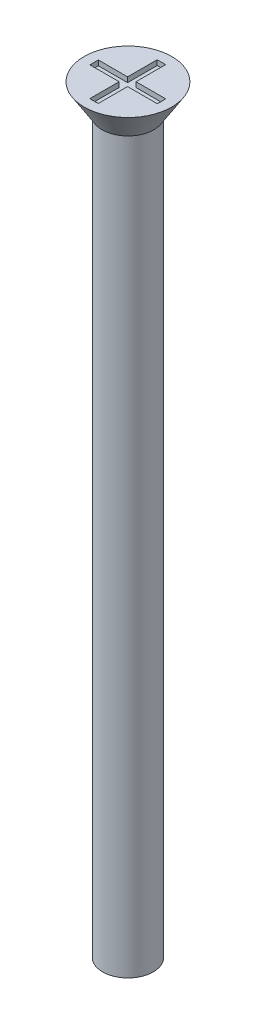
ISO-10303-21;
HEADER;
FILE_DESCRIPTION(('STEP AP214'),'2;1');
FILE_NAME('part.step','',(''),(''),'','','');
FILE_SCHEMA(('AUTOMOTIVE_DESIGN { 1 0 10303 214 1 1 1 1 }'));
ENDSEC;
DATA;
#1=APPLICATION_CONTEXT('core data for automotive mechanical design processes');
#2=APPLICATION_PROTOCOL_DEFINITION('international standard','automotive_design',2000,#1);
#3=PRODUCT_CONTEXT('',#1,'mechanical');
#4=PRODUCT('Part','Part','',(#3));
#5=PRODUCT_RELATED_PRODUCT_CATEGORY('part','',(#4));
#6=PRODUCT_DEFINITION_FORMATION('','',#4);
#7=PRODUCT_DEFINITION_CONTEXT('part definition',#1,'design');
#8=PRODUCT_DEFINITION('design','',#6,#7);
#9=PRODUCT_DEFINITION_SHAPE('','',#8);
#10=(LENGTH_UNIT() NAMED_UNIT(*) SI_UNIT(.MILLI.,.METRE.));
#11=(NAMED_UNIT(*) PLANE_ANGLE_UNIT() SI_UNIT($,.RADIAN.));
#12=(NAMED_UNIT(*) SI_UNIT($,.STERADIAN.) SOLID_ANGLE_UNIT());
#13=UNCERTAINTY_MEASURE_WITH_UNIT(LENGTH_MEASURE(1.E-05),#10,'distance_accuracy_value','');
#14=(GEOMETRIC_REPRESENTATION_CONTEXT(3) GLOBAL_UNCERTAINTY_ASSIGNED_CONTEXT((#13)) GLOBAL_UNIT_ASSIGNED_CONTEXT((#10,
#11,#12)) REPRESENTATION_CONTEXT('',''));
#15=CARTESIAN_POINT('',(0.,0.,0.));
#16=DIRECTION('',(0.,0.,1.));
#17=DIRECTION('',(1.,0.,0.));
#18=AXIS2_PLACEMENT_3D('',#15,#16,#17);
#19=CARTESIAN_POINT('',(0.,45.,0.));
#20=DIRECTION('',(0.,1.,0.));
#21=DIRECTION('',(0.,0.,1.));
#22=AXIS2_PLACEMENT_3D('',#19,#20,#21);
#23=PLANE('',#22);
#24=CARTESIAN_POINT('',(0.,45.,0.));
#25=DIRECTION('',(0.,1.,0.));
#26=DIRECTION('',(0.,0.,1.));
#27=AXIS2_PLACEMENT_3D('',#24,#25,#26);
#28=CIRCLE('',#27,2.6);
#29=CARTESIAN_POINT('',(0.,45.,2.6));
#30=VERTEX_POINT('',#29);
#31=EDGE_CURVE('E192',#30,#30,#28,.T.);
#32=ORIENTED_EDGE('',*,*,#31,.T.);
#33=EDGE_LOOP('',(#32));
#34=FACE_BOUND('',#33,.T.);
#35=DIRECTION('',(1.,0.,0.));
#36=VECTOR('',#35,1.);
#37=CARTESIAN_POINT('',(0.,45.,-2.));
#38=LINE('',#37,#36);
#39=CARTESIAN_POINT('',(-0.265272843023468,45.,-2.));
#40=VERTEX_POINT('',#39);
#41=CARTESIAN_POINT('',(0.234727156976532,45.,-2.));
#42=VERTEX_POINT('',#41);
#43=EDGE_CURVE('E161',#40,#42,#38,.T.);
#44=ORIENTED_EDGE('',*,*,#43,.T.);
#45=DIRECTION('',(0.,0.,1.));
#46=VECTOR('',#45,1.);
#47=CARTESIAN_POINT('',(0.234727156976532,45.,0.));
#48=LINE('',#47,#46);
#49=CARTESIAN_POINT('',(0.234727156976532,45.,-0.241621514992573));
#50=VERTEX_POINT('',#49);
#51=EDGE_CURVE('E48',#42,#50,#48,.T.);
#52=ORIENTED_EDGE('',*,*,#51,.T.);
#53=DIRECTION('',(1.,0.,0.));
#54=VECTOR('',#53,1.);
#55=CARTESIAN_POINT('',(0.,45.,-0.241621514992573));
#56=LINE('',#55,#54);
#57=CARTESIAN_POINT('',(2.,45.,-0.241621514992573));
#58=VERTEX_POINT('',#57);
#59=EDGE_CURVE('E98',#50,#58,#56,.T.);
#60=ORIENTED_EDGE('',*,*,#59,.T.);
#61=DIRECTION('',(0.,0.,1.));
#62=VECTOR('',#61,1.);
#63=CARTESIAN_POINT('',(2.,45.,0.));
#64=LINE('',#63,#62);
#65=CARTESIAN_POINT('',(2.,45.,0.258378485007427));
#66=VERTEX_POINT('',#65);
#67=EDGE_CURVE('E186',#58,#66,#64,.T.);
#68=ORIENTED_EDGE('',*,*,#67,.T.);
#69=DIRECTION('',(1.,0.,0.));
#70=VECTOR('',#69,1.);
#71=CARTESIAN_POINT('',(0.,45.,0.258378485007427));
#72=LINE('',#71,#70);
#73=CARTESIAN_POINT('',(0.234727156976532,45.,0.258378485007427));
#74=VERTEX_POINT('',#73);
#75=EDGE_CURVE('E145',#74,#66,#72,.T.);
#76=ORIENTED_EDGE('',*,*,#75,.F.);
#77=DIRECTION('',(0.,0.,1.));
#78=VECTOR('',#77,1.);
#79=CARTESIAN_POINT('',(0.234727156976532,45.,0.));
#80=LINE('',#79,#78);
#81=CARTESIAN_POINT('',(0.234727156976533,45.,2.));
#82=VERTEX_POINT('',#81);
#83=EDGE_CURVE('E182',#74,#82,#80,.T.);
#84=ORIENTED_EDGE('',*,*,#83,.T.);
#85=DIRECTION('',(1.,0.,0.));
#86=VECTOR('',#85,1.);
#87=CARTESIAN_POINT('',(0.,45.,2.));
#88=LINE('',#87,#86);
#89=CARTESIAN_POINT('',(-0.265272843023467,45.,2.));
#90=VERTEX_POINT('',#89);
#91=EDGE_CURVE('E179',#90,#82,#88,.T.);
#92=ORIENTED_EDGE('',*,*,#91,.F.);
#93=DIRECTION('',(0.,0.,1.));
#94=VECTOR('',#93,1.);
#95=CARTESIAN_POINT('',(-0.265272843023468,45.,0.));
#96=LINE('',#95,#94);
#97=CARTESIAN_POINT('',(-0.265272843023468,45.,0.258378485007427));
#98=VERTEX_POINT('',#97);
#99=EDGE_CURVE('E176',#98,#90,#96,.T.);
#100=ORIENTED_EDGE('',*,*,#99,.F.);
#101=DIRECTION('',(1.,0.,0.));
#102=VECTOR('',#101,1.);
#103=CARTESIAN_POINT('',(0.,45.,0.258378485007427));
#104=LINE('',#103,#102);
#105=CARTESIAN_POINT('',(-2.,45.,0.258378485007427));
#106=VERTEX_POINT('',#105);
#107=EDGE_CURVE('E173',#106,#98,#104,.T.);
#108=ORIENTED_EDGE('',*,*,#107,.F.);
#109=DIRECTION('',(0.,0.,1.));
#110=VECTOR('',#109,1.);
#111=CARTESIAN_POINT('',(-2.,45.,0.));
#112=LINE('',#111,#110);
#113=CARTESIAN_POINT('',(-2.,45.,-0.241621514992573));
#114=VERTEX_POINT('',#113);
#115=EDGE_CURVE('E170',#114,#106,#112,.T.);
#116=ORIENTED_EDGE('',*,*,#115,.F.);
#117=DIRECTION('',(1.,0.,0.));
#118=VECTOR('',#117,1.);
#119=CARTESIAN_POINT('',(0.,45.,-0.241621514992573));
#120=LINE('',#119,#118);
#121=CARTESIAN_POINT('',(-0.265272843023468,45.,-0.241621514992573));
#122=VERTEX_POINT('',#121);
#123=EDGE_CURVE('E167',#114,#122,#120,.T.);
#124=ORIENTED_EDGE('',*,*,#123,.T.);
#125=DIRECTION('',(0.,0.,1.));
#126=VECTOR('',#125,1.);
#127=CARTESIAN_POINT('',(-0.265272843023468,45.,0.));
#128=LINE('',#127,#126);
#129=EDGE_CURVE('E164',#40,#122,#128,.T.);
#130=ORIENTED_EDGE('',*,*,#129,.F.);
#131=EDGE_LOOP('',(#44,#52,#60,#68,#76,#84,#92,#100,#108,#116,#124,#130));
#132=FACE_BOUND('',#131,.T.);
#133=ADVANCED_FACE('F33',(#34,#132),#23,.T.);
#134=CARTESIAN_POINT('',(0.,45.,0.));
#135=DIRECTION('',(0.,-1.,0.));
#136=DIRECTION('',(0.,0.,-1.));
#137=AXIS2_PLACEMENT_3D('',#134,#135,#136);
#138=CYLINDRICAL_SURFACE('',#137,1.5);
#139=CARTESIAN_POINT('',(0.,0.,0.));
#140=DIRECTION('',(0.,1.,0.));
#141=DIRECTION('',(0.,0.,1.));
#142=AXIS2_PLACEMENT_3D('',#139,#140,#141);
#143=CIRCLE('',#142,1.5);
#144=CARTESIAN_POINT('',(0.,0.,1.5));
#145=VERTEX_POINT('',#144);
#146=EDGE_CURVE('E41',#145,#145,#143,.T.);
#147=ORIENTED_EDGE('',*,*,#146,.T.);
#148=EDGE_LOOP('',(#147));
#149=FACE_BOUND('',#148,.T.);
#150=CARTESIAN_POINT('',(0.,43.3,0.));
#151=DIRECTION('',(0.,1.,0.));
#152=DIRECTION('',(0.,0.,1.));
#153=AXIS2_PLACEMENT_3D('',#150,#151,#152);
#154=CIRCLE('',#153,1.5);
#155=CARTESIAN_POINT('',(0.,43.3,1.5));
#156=VERTEX_POINT('',#155);
#157=EDGE_CURVE('E11',#156,#156,#154,.T.);
#158=ORIENTED_EDGE('',*,*,#157,.F.);
#159=EDGE_LOOP('',(#158));
#160=FACE_BOUND('',#159,.T.);
#161=ADVANCED_FACE('F35',(#149,#160),#138,.T.);
#162=CARTESIAN_POINT('',(0.,0.,0.));
#163=DIRECTION('',(0.,1.,0.));
#164=DIRECTION('',(0.,0.,1.));
#165=AXIS2_PLACEMENT_3D('',#162,#163,#164);
#166=PLANE('',#165);
#167=ORIENTED_EDGE('',*,*,#146,.F.);
#168=EDGE_LOOP('',(#167));
#169=FACE_BOUND('',#168,.T.);
#170=ADVANCED_FACE('F219',(#169),#166,.F.);
#171=CARTESIAN_POINT('',(0.,45.,0.));
#172=DIRECTION('',(0.,1.,0.));
#173=DIRECTION('',(0.,0.,1.));
#174=AXIS2_PLACEMENT_3D('',#171,#172,#173);
#175=CONICAL_SURFACE('',#174,2.6,0.558505360638187);
#176=CARTESIAN_POINT('',(0.,43.3,0.));
#177=DIRECTION('',(0.,1.,0.));
#178=DIRECTION('',(0.,0.,1.));
#179=AXIS2_PLACEMENT_3D('',#176,#177,#178);
#180=CIRCLE('',#179,1.53772210175414);
#181=CARTESIAN_POINT('',(0.,43.3,1.53772210175414));
#182=VERTEX_POINT('',#181);
#183=EDGE_CURVE('E212',#182,#182,#180,.T.);
#184=ORIENTED_EDGE('',*,*,#183,.T.);
#185=EDGE_LOOP('',(#184));
#186=FACE_BOUND('',#185,.T.);
#187=ORIENTED_EDGE('',*,*,#31,.F.);
#188=EDGE_LOOP('',(#187));
#189=FACE_BOUND('',#188,.T.);
#190=ADVANCED_FACE('F221',(#186,#189),#175,.T.);
#191=CARTESIAN_POINT('',(0.,43.3,0.));
#192=DIRECTION('',(0.,1.,0.));
#193=DIRECTION('',(0.,0.,1.));
#194=AXIS2_PLACEMENT_3D('',#191,#192,#193);
#195=PLANE('',#194);
#196=ORIENTED_EDGE('',*,*,#157,.T.);
#197=EDGE_LOOP('',(#196));
#198=FACE_BOUND('',#197,.T.);
#199=ORIENTED_EDGE('',*,*,#183,.F.);
#200=EDGE_LOOP('',(#199));
#201=FACE_BOUND('',#200,.T.);
#202=ADVANCED_FACE('F226',(#198,#201),#195,.F.);
#203=CARTESIAN_POINT('',(0.234727156976532,44.7,0.));
#204=DIRECTION('',(-1.,0.,0.));
#205=DIRECTION('',(0.,0.,1.));
#206=AXIS2_PLACEMENT_3D('',#203,#204,#205);
#207=PLANE('',#206);
#208=ORIENTED_EDGE('',*,*,#51,.F.);
#209=DIRECTION('',(0.,1.,0.));
#210=VECTOR('',#209,1.);
#211=CARTESIAN_POINT('',(0.234727156976532,44.7,-2.));
#212=LINE('',#211,#210);
#213=CARTESIAN_POINT('',(0.234727156976532,44.7,-2.));
#214=VERTEX_POINT('',#213);
#215=EDGE_CURVE('E159',#214,#42,#212,.T.);
#216=ORIENTED_EDGE('',*,*,#215,.F.);
#217=DIRECTION('',(0.,0.,1.));
#218=VECTOR('',#217,1.);
#219=CARTESIAN_POINT('',(0.234727156976532,44.7,0.));
#220=LINE('',#219,#218);
#221=CARTESIAN_POINT('',(0.234727156976532,44.7,-0.241621514992573));
#222=VERTEX_POINT('',#221);
#223=EDGE_CURVE('E189',#214,#222,#220,.T.);
#224=ORIENTED_EDGE('',*,*,#223,.T.);
#225=DIRECTION('',(0.,1.,0.));
#226=VECTOR('',#225,1.);
#227=CARTESIAN_POINT('',(0.234727156976532,44.7,-0.241621514992573));
#228=LINE('',#227,#226);
#229=EDGE_CURVE('E190',#222,#50,#228,.T.);
#230=ORIENTED_EDGE('',*,*,#229,.T.);
#231=EDGE_LOOP('',(#208,#216,#224,#230));
#232=FACE_BOUND('',#231,.T.);
#233=ADVANCED_FACE('F238',(#232),#207,.T.);
#234=CARTESIAN_POINT('',(0.,44.7,-0.241621514992573));
#235=DIRECTION('',(0.,0.,1.));
#236=DIRECTION('',(1.,0.,0.));
#237=AXIS2_PLACEMENT_3D('',#234,#235,#236);
#238=PLANE('',#237);
#239=ORIENTED_EDGE('',*,*,#59,.F.);
#240=ORIENTED_EDGE('',*,*,#229,.F.);
#241=DIRECTION('',(1.,0.,0.));
#242=VECTOR('',#241,1.);
#243=CARTESIAN_POINT('',(0.,44.7,-0.241621514992573));
#244=LINE('',#243,#242);
#245=CARTESIAN_POINT('',(2.,44.7,-0.241621514992573));
#246=VERTEX_POINT('',#245);
#247=EDGE_CURVE('E57',#222,#246,#244,.T.);
#248=ORIENTED_EDGE('',*,*,#247,.T.);
#249=DIRECTION('',(0.,1.,0.));
#250=VECTOR('',#249,1.);
#251=CARTESIAN_POINT('',(2.,44.7,-0.241621514992573));
#252=LINE('',#251,#250);
#253=EDGE_CURVE('E137',#246,#58,#252,.T.);
#254=ORIENTED_EDGE('',*,*,#253,.T.);
#255=EDGE_LOOP('',(#239,#240,#248,#254));
#256=FACE_BOUND('',#255,.T.);
#257=ADVANCED_FACE('F242',(#256),#238,.T.);
#258=CARTESIAN_POINT('',(2.,44.7,0.));
#259=DIRECTION('',(-1.,0.,0.));
#260=DIRECTION('',(0.,0.,1.));
#261=AXIS2_PLACEMENT_3D('',#258,#259,#260);
#262=PLANE('',#261);
#263=ORIENTED_EDGE('',*,*,#67,.F.);
#264=ORIENTED_EDGE('',*,*,#253,.F.);
#265=DIRECTION('',(0.,0.,1.));
#266=VECTOR('',#265,1.);
#267=CARTESIAN_POINT('',(2.,44.7,0.));
#268=LINE('',#267,#266);
#269=CARTESIAN_POINT('',(2.,44.7,0.258378485007427));
#270=VERTEX_POINT('',#269);
#271=EDGE_CURVE('E131',#246,#270,#268,.T.);
#272=ORIENTED_EDGE('',*,*,#271,.T.);
#273=DIRECTION('',(0.,1.,0.));
#274=VECTOR('',#273,1.);
#275=CARTESIAN_POINT('',(2.,44.7,0.258378485007427));
#276=LINE('',#275,#274);
#277=EDGE_CURVE('E135',#270,#66,#276,.T.);
#278=ORIENTED_EDGE('',*,*,#277,.T.);
#279=EDGE_LOOP('',(#263,#264,#272,#278));
#280=FACE_BOUND('',#279,.T.);
#281=ADVANCED_FACE('F134',(#280),#262,.T.);
#282=CARTESIAN_POINT('',(0.,44.7,0.258378485007427));
#283=DIRECTION('',(0.,0.,1.));
#284=DIRECTION('',(1.,0.,0.));
#285=AXIS2_PLACEMENT_3D('',#282,#283,#284);
#286=PLANE('',#285);
#287=ORIENTED_EDGE('',*,*,#75,.T.);
#288=ORIENTED_EDGE('',*,*,#277,.F.);
#289=DIRECTION('',(1.,0.,0.));
#290=VECTOR('',#289,1.);
#291=CARTESIAN_POINT('',(0.,44.7,0.258378485007427));
#292=LINE('',#291,#290);
#293=CARTESIAN_POINT('',(0.234727156976532,44.7,0.258378485007427));
#294=VERTEX_POINT('',#293);
#295=EDGE_CURVE('E139',#294,#270,#292,.T.);
#296=ORIENTED_EDGE('',*,*,#295,.F.);
#297=DIRECTION('',(0.,1.,0.));
#298=VECTOR('',#297,1.);
#299=CARTESIAN_POINT('',(0.234727156976532,44.7,0.258378485007427));
#300=LINE('',#299,#298);
#301=EDGE_CURVE('E147',#294,#74,#300,.T.);
#302=ORIENTED_EDGE('',*,*,#301,.T.);
#303=EDGE_LOOP('',(#287,#288,#296,#302));
#304=FACE_BOUND('',#303,.T.);
#305=ADVANCED_FACE('F143',(#304),#286,.F.);
#306=CARTESIAN_POINT('',(0.234727156976532,44.7,0.));
#307=DIRECTION('',(-1.,0.,0.));
#308=DIRECTION('',(0.,0.,1.));
#309=AXIS2_PLACEMENT_3D('',#306,#307,#308);
#310=PLANE('',#309);
#311=ORIENTED_EDGE('',*,*,#83,.F.);
#312=ORIENTED_EDGE('',*,*,#301,.F.);
#313=DIRECTION('',(0.,0.,1.));
#314=VECTOR('',#313,1.);
#315=CARTESIAN_POINT('',(0.234727156976532,44.7,0.));
#316=LINE('',#315,#314);
#317=CARTESIAN_POINT('',(0.234727156976533,44.7,2.));
#318=VERTEX_POINT('',#317);
#319=EDGE_CURVE('E152',#294,#318,#316,.T.);
#320=ORIENTED_EDGE('',*,*,#319,.T.);
#321=DIRECTION('',(0.,1.,0.));
#322=VECTOR('',#321,1.);
#323=CARTESIAN_POINT('',(0.234727156976533,44.7,2.));
#324=LINE('',#323,#322);
#325=EDGE_CURVE('E195',#318,#82,#324,.T.);
#326=ORIENTED_EDGE('',*,*,#325,.T.);
#327=EDGE_LOOP('',(#311,#312,#320,#326));
#328=FACE_BOUND('',#327,.T.);
#329=ADVANCED_FACE('F269',(#328),#310,.T.);
#330=CARTESIAN_POINT('',(0.,44.7,2.));
#331=DIRECTION('',(0.,0.,1.));
#332=DIRECTION('',(1.,0.,0.));
#333=AXIS2_PLACEMENT_3D('',#330,#331,#332);
#334=PLANE('',#333);
#335=ORIENTED_EDGE('',*,*,#91,.T.);
#336=ORIENTED_EDGE('',*,*,#325,.F.);
#337=DIRECTION('',(1.,0.,0.));
#338=VECTOR('',#337,1.);
#339=CARTESIAN_POINT('',(0.,44.7,2.));
#340=LINE('',#339,#338);
#341=CARTESIAN_POINT('',(-0.265272843023467,44.7,2.));
#342=VERTEX_POINT('',#341);
#343=EDGE_CURVE('E154',#342,#318,#340,.T.);
#344=ORIENTED_EDGE('',*,*,#343,.F.);
#345=DIRECTION('',(0.,1.,0.));
#346=VECTOR('',#345,1.);
#347=CARTESIAN_POINT('',(-0.265272843023467,44.7,2.));
#348=LINE('',#347,#346);
#349=EDGE_CURVE('E197',#342,#90,#348,.T.);
#350=ORIENTED_EDGE('',*,*,#349,.T.);
#351=EDGE_LOOP('',(#335,#336,#344,#350));
#352=FACE_BOUND('',#351,.T.);
#353=ADVANCED_FACE('F265',(#352),#334,.F.);
#354=CARTESIAN_POINT('',(-0.265272843023468,44.7,0.));
#355=DIRECTION('',(-1.,0.,0.));
#356=DIRECTION('',(0.,0.,1.));
#357=AXIS2_PLACEMENT_3D('',#354,#355,#356);
#358=PLANE('',#357);
#359=ORIENTED_EDGE('',*,*,#99,.T.);
#360=ORIENTED_EDGE('',*,*,#349,.F.);
#361=DIRECTION('',(0.,0.,1.));
#362=VECTOR('',#361,1.);
#363=CARTESIAN_POINT('',(-0.265272843023468,44.7,0.));
#364=LINE('',#363,#362);
#365=CARTESIAN_POINT('',(-0.265272843023468,44.7,0.258378485007427));
#366=VERTEX_POINT('',#365);
#367=EDGE_CURVE('E417',#366,#342,#364,.T.);
#368=ORIENTED_EDGE('',*,*,#367,.F.);
#369=DIRECTION('',(0.,1.,0.));
#370=VECTOR('',#369,1.);
#371=CARTESIAN_POINT('',(-0.265272843023468,44.7,0.258378485007427));
#372=LINE('',#371,#370);
#373=EDGE_CURVE('E199',#366,#98,#372,.T.);
#374=ORIENTED_EDGE('',*,*,#373,.T.);
#375=EDGE_LOOP('',(#359,#360,#368,#374));
#376=FACE_BOUND('',#375,.T.);
#377=ADVANCED_FACE('F261',(#376),#358,.F.);
#378=CARTESIAN_POINT('',(0.,44.7,0.258378485007427));
#379=DIRECTION('',(0.,0.,1.));
#380=DIRECTION('',(1.,0.,0.));
#381=AXIS2_PLACEMENT_3D('',#378,#379,#380);
#382=PLANE('',#381);
#383=ORIENTED_EDGE('',*,*,#107,.T.);
#384=ORIENTED_EDGE('',*,*,#373,.F.);
#385=DIRECTION('',(1.,0.,0.));
#386=VECTOR('',#385,1.);
#387=CARTESIAN_POINT('',(0.,44.7,0.258378485007427));
#388=LINE('',#387,#386);
#389=CARTESIAN_POINT('',(-2.,44.7,0.258378485007427));
#390=VERTEX_POINT('',#389);
#391=EDGE_CURVE('E414',#390,#366,#388,.T.);
#392=ORIENTED_EDGE('',*,*,#391,.F.);
#393=DIRECTION('',(0.,1.,0.));
#394=VECTOR('',#393,1.);
#395=CARTESIAN_POINT('',(-2.,44.7,0.258378485007427));
#396=LINE('',#395,#394);
#397=EDGE_CURVE('E201',#390,#106,#396,.T.);
#398=ORIENTED_EDGE('',*,*,#397,.T.);
#399=EDGE_LOOP('',(#383,#384,#392,#398));
#400=FACE_BOUND('',#399,.T.);
#401=ADVANCED_FACE('F257',(#400),#382,.F.);
#402=CARTESIAN_POINT('',(-2.,44.7,0.));
#403=DIRECTION('',(-1.,0.,0.));
#404=DIRECTION('',(0.,0.,1.));
#405=AXIS2_PLACEMENT_3D('',#402,#403,#404);
#406=PLANE('',#405);
#407=ORIENTED_EDGE('',*,*,#115,.T.);
#408=ORIENTED_EDGE('',*,*,#397,.F.);
#409=DIRECTION('',(0.,0.,1.));
#410=VECTOR('',#409,1.);
#411=CARTESIAN_POINT('',(-2.,44.7,0.));
#412=LINE('',#411,#410);
#413=CARTESIAN_POINT('',(-2.,44.7,-0.241621514992573));
#414=VERTEX_POINT('',#413);
#415=EDGE_CURVE('E411',#414,#390,#412,.T.);
#416=ORIENTED_EDGE('',*,*,#415,.F.);
#417=DIRECTION('',(0.,1.,0.));
#418=VECTOR('',#417,1.);
#419=CARTESIAN_POINT('',(-2.,44.7,-0.241621514992573));
#420=LINE('',#419,#418);
#421=EDGE_CURVE('E203',#414,#114,#420,.T.);
#422=ORIENTED_EDGE('',*,*,#421,.T.);
#423=EDGE_LOOP('',(#407,#408,#416,#422));
#424=FACE_BOUND('',#423,.T.);
#425=ADVANCED_FACE('F253',(#424),#406,.F.);
#426=CARTESIAN_POINT('',(0.,44.7,-0.241621514992573));
#427=DIRECTION('',(0.,0.,1.));
#428=DIRECTION('',(1.,0.,0.));
#429=AXIS2_PLACEMENT_3D('',#426,#427,#428);
#430=PLANE('',#429);
#431=ORIENTED_EDGE('',*,*,#123,.F.);
#432=ORIENTED_EDGE('',*,*,#421,.F.);
#433=DIRECTION('',(1.,0.,0.));
#434=VECTOR('',#433,1.);
#435=CARTESIAN_POINT('',(0.,44.7,-0.241621514992573));
#436=LINE('',#435,#434);
#437=CARTESIAN_POINT('',(-0.265272843023468,44.7,-0.241621514992573));
#438=VERTEX_POINT('',#437);
#439=EDGE_CURVE('E409',#414,#438,#436,.T.);
#440=ORIENTED_EDGE('',*,*,#439,.T.);
#441=DIRECTION('',(0.,1.,0.));
#442=VECTOR('',#441,1.);
#443=CARTESIAN_POINT('',(-0.265272843023468,44.7,-0.241621514992573));
#444=LINE('',#443,#442);
#445=EDGE_CURVE('E205',#438,#122,#444,.T.);
#446=ORIENTED_EDGE('',*,*,#445,.T.);
#447=EDGE_LOOP('',(#431,#432,#440,#446));
#448=FACE_BOUND('',#447,.T.);
#449=ADVANCED_FACE('F249',(#448),#430,.T.);
#450=CARTESIAN_POINT('',(-0.265272843023468,44.7,0.));
#451=DIRECTION('',(-1.,0.,0.));
#452=DIRECTION('',(0.,0.,1.));
#453=AXIS2_PLACEMENT_3D('',#450,#451,#452);
#454=PLANE('',#453);
#455=ORIENTED_EDGE('',*,*,#129,.T.);
#456=ORIENTED_EDGE('',*,*,#445,.F.);
#457=DIRECTION('',(0.,0.,1.));
#458=VECTOR('',#457,1.);
#459=CARTESIAN_POINT('',(-0.265272843023468,44.7,0.));
#460=LINE('',#459,#458);
#461=CARTESIAN_POINT('',(-0.265272843023468,44.7,-2.));
#462=VERTEX_POINT('',#461);
#463=EDGE_CURVE('E405',#462,#438,#460,.T.);
#464=ORIENTED_EDGE('',*,*,#463,.F.);
#465=DIRECTION('',(0.,1.,0.));
#466=VECTOR('',#465,1.);
#467=CARTESIAN_POINT('',(-0.265272843023468,44.7,-2.));
#468=LINE('',#467,#466);
#469=EDGE_CURVE('E207',#462,#40,#468,.T.);
#470=ORIENTED_EDGE('',*,*,#469,.T.);
#471=EDGE_LOOP('',(#455,#456,#464,#470));
#472=FACE_BOUND('',#471,.T.);
#473=ADVANCED_FACE('F246',(#472),#454,.F.);
#474=CARTESIAN_POINT('',(0.,44.7,-2.));
#475=DIRECTION('',(0.,0.,1.));
#476=DIRECTION('',(1.,0.,0.));
#477=AXIS2_PLACEMENT_3D('',#474,#475,#476);
#478=PLANE('',#477);
#479=ORIENTED_EDGE('',*,*,#43,.F.);
#480=ORIENTED_EDGE('',*,*,#469,.F.);
#481=DIRECTION('',(1.,0.,0.));
#482=VECTOR('',#481,1.);
#483=CARTESIAN_POINT('',(0.,44.7,-2.));
#484=LINE('',#483,#482);
#485=EDGE_CURVE('E105',#462,#214,#484,.T.);
#486=ORIENTED_EDGE('',*,*,#485,.T.);
#487=ORIENTED_EDGE('',*,*,#215,.T.);
#488=EDGE_LOOP('',(#479,#480,#486,#487));
#489=FACE_BOUND('',#488,.T.);
#490=ADVANCED_FACE('F243',(#489),#478,.T.);
#491=CARTESIAN_POINT('',(0.,44.7,0.));
#492=DIRECTION('',(0.,1.,0.));
#493=DIRECTION('',(0.,0.,1.));
#494=AXIS2_PLACEMENT_3D('',#491,#492,#493);
#495=PLANE('',#494);
#496=ORIENTED_EDGE('',*,*,#223,.F.);
#497=ORIENTED_EDGE('',*,*,#485,.F.);
#498=ORIENTED_EDGE('',*,*,#463,.T.);
#499=ORIENTED_EDGE('',*,*,#439,.F.);
#500=ORIENTED_EDGE('',*,*,#415,.T.);
#501=ORIENTED_EDGE('',*,*,#391,.T.);
#502=ORIENTED_EDGE('',*,*,#367,.T.);
#503=ORIENTED_EDGE('',*,*,#343,.T.);
#504=ORIENTED_EDGE('',*,*,#319,.F.);
#505=ORIENTED_EDGE('',*,*,#295,.T.);
#506=ORIENTED_EDGE('',*,*,#271,.F.);
#507=ORIENTED_EDGE('',*,*,#247,.F.);
#508=EDGE_LOOP('',(#496,#497,#498,#499,#500,#501,#502,#503,#504,#505,#506,#507));
#509=FACE_BOUND('',#508,.T.);
#510=ADVANCED_FACE('F150',(#509),#495,.T.);
#511=CLOSED_SHELL('',(#133,#161,#170,#190,#202,#233,#257,#281,#305,#329,#353,#377,#401,#425,
#449,#473,#490,#510));
#512=MANIFOLD_SOLID_BREP('B2',#511);
#513=ADVANCED_BREP_SHAPE_REPRESENTATION('',(#18,#512),#14);
#514=SHAPE_DEFINITION_REPRESENTATION(#9,#513);
ENDSEC;
END-ISO-10303-21;
